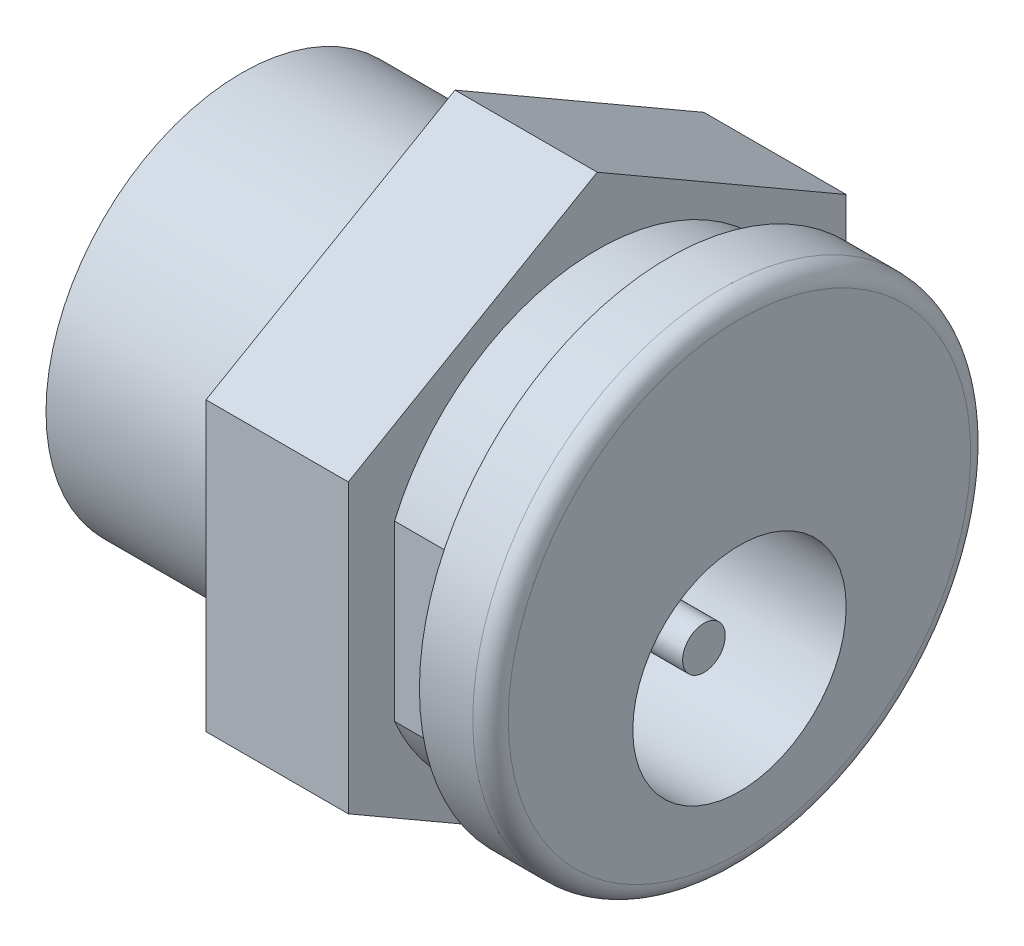
ISO-10303-21;
HEADER;
FILE_DESCRIPTION(('STEP AP214'),'2;1');
FILE_NAME('part.step','',(''),(''),'','','');
FILE_SCHEMA(('AUTOMOTIVE_DESIGN { 1 0 10303 214 1 1 1 1 }'));
ENDSEC;
DATA;
#1=APPLICATION_CONTEXT('core data for automotive mechanical design processes');
#2=APPLICATION_PROTOCOL_DEFINITION('international standard','automotive_design',2000,#1);
#3=PRODUCT_CONTEXT('',#1,'mechanical');
#4=PRODUCT('Part','Part','',(#3));
#5=PRODUCT_RELATED_PRODUCT_CATEGORY('part','',(#4));
#6=PRODUCT_DEFINITION_FORMATION('','',#4);
#7=PRODUCT_DEFINITION_CONTEXT('part definition',#1,'design');
#8=PRODUCT_DEFINITION('design','',#6,#7);
#9=PRODUCT_DEFINITION_SHAPE('','',#8);
#10=(LENGTH_UNIT() NAMED_UNIT(*) SI_UNIT(.MILLI.,.METRE.));
#11=(NAMED_UNIT(*) PLANE_ANGLE_UNIT() SI_UNIT($,.RADIAN.));
#12=(NAMED_UNIT(*) SI_UNIT($,.STERADIAN.) SOLID_ANGLE_UNIT());
#13=UNCERTAINTY_MEASURE_WITH_UNIT(LENGTH_MEASURE(1.E-05),#10,'distance_accuracy_value','');
#14=(GEOMETRIC_REPRESENTATION_CONTEXT(3) GLOBAL_UNCERTAINTY_ASSIGNED_CONTEXT((#13)) GLOBAL_UNIT_ASSIGNED_CONTEXT((#10,
#11,#12)) REPRESENTATION_CONTEXT('',''));
#15=CARTESIAN_POINT('',(0.,0.,0.));
#16=DIRECTION('',(0.,0.,1.));
#17=DIRECTION('',(1.,0.,0.));
#18=AXIS2_PLACEMENT_3D('',#15,#16,#17);
#19=CARTESIAN_POINT('',(0.,0.,0.));
#20=DIRECTION('',(-1.,0.,0.));
#21=DIRECTION('',(0.,0.,1.));
#22=AXIS2_PLACEMENT_3D('',#19,#20,#21);
#23=CYLINDRICAL_SURFACE('',#22,6.2);
#24=CARTESIAN_POINT('',(-2.,0.,0.));
#25=DIRECTION('',(-1.,0.,0.));
#26=DIRECTION('',(0.,0.,1.));
#27=AXIS2_PLACEMENT_3D('',#24,#25,#26);
#28=CIRCLE('',#27,6.2);
#29=CARTESIAN_POINT('',(-2.,-2.4392621835301,-5.7));
#30=VERTEX_POINT('',#29);
#31=CARTESIAN_POINT('',(-2.,-2.43926218353009,5.7));
#32=VERTEX_POINT('',#31);
#33=EDGE_CURVE('E125',#30,#32,#28,.T.);
#34=ORIENTED_EDGE('',*,*,#33,.T.);
#35=DIRECTION('',(-1.,0.,0.));
#36=VECTOR('',#35,1.);
#37=CARTESIAN_POINT('',(-2.,-2.4392621835301,5.7));
#38=LINE('',#37,#36);
#39=CARTESIAN_POINT('',(-4.,-2.4392621835301,5.7));
#40=VERTEX_POINT('',#39);
#41=EDGE_CURVE('E109',#32,#40,#38,.T.);
#42=ORIENTED_EDGE('',*,*,#41,.T.);
#43=CARTESIAN_POINT('',(-4.,0.,0.));
#44=DIRECTION('',(-1.,0.,0.));
#45=DIRECTION('',(0.,0.,1.));
#46=AXIS2_PLACEMENT_3D('',#43,#44,#45);
#47=CIRCLE('',#46,6.2);
#48=CARTESIAN_POINT('',(-4.,-2.4392621835301,-5.7));
#49=VERTEX_POINT('',#48);
#50=EDGE_CURVE('E126',#49,#40,#47,.T.);
#51=ORIENTED_EDGE('',*,*,#50,.F.);
#52=DIRECTION('',(-1.,0.,0.));
#53=VECTOR('',#52,1.);
#54=CARTESIAN_POINT('',(-2.,-2.4392621835301,-5.7));
#55=LINE('',#54,#53);
#56=EDGE_CURVE('E50',#30,#49,#55,.T.);
#57=ORIENTED_EDGE('',*,*,#56,.F.);
#58=EDGE_LOOP('',(#34,#42,#51,#57));
#59=FACE_BOUND('',#58,.T.);
#60=ADVANCED_FACE('F27',(#59),#23,.T.);
#61=CARTESIAN_POINT('',(-4.,2.4392621835301,5.7));
#62=VERTEX_POINT('',#61);
#63=CARTESIAN_POINT('',(-4.,2.4392621835301,-5.7));
#64=VERTEX_POINT('',#63);
#65=EDGE_CURVE('E119',#62,#64,#47,.T.);
#66=ORIENTED_EDGE('',*,*,#65,.F.);
#67=DIRECTION('',(-1.,0.,0.));
#68=VECTOR('',#67,1.);
#69=CARTESIAN_POINT('',(-2.,2.4392621835301,5.7));
#70=LINE('',#69,#68);
#71=CARTESIAN_POINT('',(-2.,2.4392621835301,5.7));
#72=VERTEX_POINT('',#71);
#73=EDGE_CURVE('E106',#72,#62,#70,.T.);
#74=ORIENTED_EDGE('',*,*,#73,.F.);
#75=CARTESIAN_POINT('',(-2.,2.4392621835301,-5.7));
#76=VERTEX_POINT('',#75);
#77=EDGE_CURVE('E117',#72,#76,#28,.T.);
#78=ORIENTED_EDGE('',*,*,#77,.T.);
#79=DIRECTION('',(-1.,0.,0.));
#80=VECTOR('',#79,1.);
#81=CARTESIAN_POINT('',(-2.,2.4392621835301,-5.7));
#82=LINE('',#81,#80);
#83=EDGE_CURVE('E185',#76,#64,#82,.T.);
#84=ORIENTED_EDGE('',*,*,#83,.T.);
#85=EDGE_LOOP('',(#66,#74,#78,#84));
#86=FACE_BOUND('',#85,.T.);
#87=ADVANCED_FACE('F115',(#86),#23,.T.);
#88=CARTESIAN_POINT('',(-9.,-2.,0.));
#89=DIRECTION('',(1.,0.,0.));
#90=DIRECTION('',(0.,0.,-1.));
#91=AXIS2_PLACEMENT_3D('',#88,#89,#90);
#92=CYLINDRICAL_SURFACE('',#91,0.6);
#93=CARTESIAN_POINT('',(-9.,-2.,0.));
#94=DIRECTION('',(1.,0.,0.));
#95=DIRECTION('',(0.,0.,-1.));
#96=AXIS2_PLACEMENT_3D('',#93,#94,#95);
#97=CIRCLE('',#96,0.6);
#98=CARTESIAN_POINT('',(-9.,-2.,-0.6));
#99=VERTEX_POINT('',#98);
#100=EDGE_CURVE('E178',#99,#99,#97,.T.);
#101=ORIENTED_EDGE('',*,*,#100,.T.);
#102=EDGE_LOOP('',(#101));
#103=FACE_BOUND('',#102,.T.);
#104=CARTESIAN_POINT('',(-1.,-2.,0.));
#105=DIRECTION('',(1.,0.,0.));
#106=DIRECTION('',(0.,0.,-1.));
#107=AXIS2_PLACEMENT_3D('',#104,#105,#106);
#108=CIRCLE('',#107,0.6);
#109=CARTESIAN_POINT('',(-1.,-2.,-0.6));
#110=VERTEX_POINT('',#109);
#111=EDGE_CURVE('E179',#110,#110,#108,.T.);
#112=ORIENTED_EDGE('',*,*,#111,.F.);
#113=EDGE_LOOP('',(#112));
#114=FACE_BOUND('',#113,.T.);
#115=ADVANCED_FACE('F158',(#103,#114),#92,.T.);
#116=CARTESIAN_POINT('',(-4.,6.2,0.));
#117=DIRECTION('',(-1.,0.,0.));
#118=DIRECTION('',(0.,0.,1.));
#119=AXIS2_PLACEMENT_3D('',#116,#117,#118);
#120=PLANE('',#119);
#121=ORIENTED_EDGE('',*,*,#50,.T.);
#122=DIRECTION('',(0.,-1.,0.));
#123=VECTOR('',#122,1.);
#124=CARTESIAN_POINT('',(-4.,2.4392621835301,5.7));
#125=LINE('',#124,#123);
#126=EDGE_CURVE('E111',#62,#40,#125,.T.);
#127=ORIENTED_EDGE('',*,*,#126,.F.);
#128=ORIENTED_EDGE('',*,*,#65,.T.);
#129=DIRECTION('',(0.,-1.,0.));
#130=VECTOR('',#129,1.);
#131=CARTESIAN_POINT('',(-4.,2.4392621835301,-5.7));
#132=LINE('',#131,#130);
#133=EDGE_CURVE('E246',#64,#49,#132,.T.);
#134=ORIENTED_EDGE('',*,*,#133,.T.);
#135=EDGE_LOOP('',(#121,#127,#128,#134));
#136=FACE_BOUND('',#135,.T.);
#137=DIRECTION('',(0.,0.5,-0.866025403784439));
#138=VECTOR('',#137,1.);
#139=CARTESIAN_POINT('',(-4.,4.04145188432738,7.));
#140=LINE('',#139,#138);
#141=CARTESIAN_POINT('',(-4.,4.04145188432738,7.));
#142=VERTEX_POINT('',#141);
#143=CARTESIAN_POINT('',(-4.,8.08290376865476,0.));
#144=VERTEX_POINT('',#143);
#145=EDGE_CURVE('E209',#142,#144,#140,.T.);
#146=ORIENTED_EDGE('',*,*,#145,.F.);
#147=DIRECTION('',(0.,1.,0.));
#148=VECTOR('',#147,1.);
#149=CARTESIAN_POINT('',(-4.,-4.04145188432739,7.));
#150=LINE('',#149,#148);
#151=CARTESIAN_POINT('',(-4.,-4.04145188432739,7.));
#152=VERTEX_POINT('',#151);
#153=EDGE_CURVE('E223',#152,#142,#150,.T.);
#154=ORIENTED_EDGE('',*,*,#153,.F.);
#155=DIRECTION('',(0.,0.5,0.866025403784439));
#156=VECTOR('',#155,1.);
#157=CARTESIAN_POINT('',(-4.,-8.08290376865476,0.));
#158=LINE('',#157,#156);
#159=CARTESIAN_POINT('',(-4.,-8.08290376865476,0.));
#160=VERTEX_POINT('',#159);
#161=EDGE_CURVE('E220',#160,#152,#158,.T.);
#162=ORIENTED_EDGE('',*,*,#161,.F.);
#163=DIRECTION('',(0.,-0.5,0.866025403784439));
#164=VECTOR('',#163,1.);
#165=CARTESIAN_POINT('',(-4.,-4.04145188432738,-7.));
#166=LINE('',#165,#164);
#167=CARTESIAN_POINT('',(-4.,-4.04145188432738,-7.));
#168=VERTEX_POINT('',#167);
#169=EDGE_CURVE('E217',#168,#160,#166,.T.);
#170=ORIENTED_EDGE('',*,*,#169,.F.);
#171=DIRECTION('',(0.,-1.,0.));
#172=VECTOR('',#171,1.);
#173=CARTESIAN_POINT('',(-4.,4.04145188432738,-7.));
#174=LINE('',#173,#172);
#175=CARTESIAN_POINT('',(-4.,4.04145188432738,-7.));
#176=VERTEX_POINT('',#175);
#177=EDGE_CURVE('E214',#176,#168,#174,.T.);
#178=ORIENTED_EDGE('',*,*,#177,.F.);
#179=DIRECTION('',(0.,-0.5,-0.866025403784439));
#180=VECTOR('',#179,1.);
#181=CARTESIAN_POINT('',(-4.,8.08290376865476,0.));
#182=LINE('',#181,#180);
#183=EDGE_CURVE('E211',#144,#176,#182,.T.);
#184=ORIENTED_EDGE('',*,*,#183,.F.);
#185=EDGE_LOOP('',(#146,#154,#162,#170,#178,#184));
#186=FACE_BOUND('',#185,.T.);
#187=ADVANCED_FACE('F161',(#136,#186),#120,.F.);
#188=CARTESIAN_POINT('',(0.,0.,0.));
#189=DIRECTION('',(-1.,0.,0.));
#190=DIRECTION('',(0.,0.,1.));
#191=AXIS2_PLACEMENT_3D('',#188,#189,#190);
#192=PLANE('',#191);
#193=CARTESIAN_POINT('',(0.,0.,0.));
#194=DIRECTION('',(-1.,0.,0.));
#195=DIRECTION('',(0.,0.,1.));
#196=AXIS2_PLACEMENT_3D('',#193,#194,#195);
#197=CIRCLE('',#196,6.5);
#198=CARTESIAN_POINT('',(0.,0.,6.5));
#199=VERTEX_POINT('',#198);
#200=EDGE_CURVE('E11',#199,#199,#197,.F.);
#201=ORIENTED_EDGE('',*,*,#200,.T.);
#202=EDGE_LOOP('',(#201));
#203=FACE_BOUND('',#202,.T.);
#204=CARTESIAN_POINT('',(0.,-2.,0.));
#205=DIRECTION('',(1.,0.,0.));
#206=DIRECTION('',(0.,0.,-1.));
#207=AXIS2_PLACEMENT_3D('',#204,#205,#206);
#208=CIRCLE('',#207,3.);
#209=CARTESIAN_POINT('',(0.,-2.,-3.));
#210=VERTEX_POINT('',#209);
#211=EDGE_CURVE('E176',#210,#210,#208,.T.);
#212=ORIENTED_EDGE('',*,*,#211,.F.);
#213=EDGE_LOOP('',(#212));
#214=FACE_BOUND('',#213,.T.);
#215=ADVANCED_FACE('F29',(#203,#214),#192,.F.);
#216=CARTESIAN_POINT('',(0.,0.,0.));
#217=DIRECTION('',(-1.,0.,0.));
#218=DIRECTION('',(0.,0.,1.));
#219=AXIS2_PLACEMENT_3D('',#216,#217,#218);
#220=CYLINDRICAL_SURFACE('',#219,7.);
#221=CARTESIAN_POINT('',(-0.5,0.,0.));
#222=DIRECTION('',(-1.,0.,0.));
#223=DIRECTION('',(0.,0.,1.));
#224=AXIS2_PLACEMENT_3D('',#221,#222,#223);
#225=CIRCLE('',#224,7.);
#226=CARTESIAN_POINT('',(-0.5,0.,7.));
#227=VERTEX_POINT('',#226);
#228=EDGE_CURVE('E35',#227,#227,#225,.T.);
#229=ORIENTED_EDGE('',*,*,#228,.T.);
#230=EDGE_LOOP('',(#229));
#231=FACE_BOUND('',#230,.T.);
#232=CARTESIAN_POINT('',(-2.,0.,0.));
#233=DIRECTION('',(-1.,0.,0.));
#234=DIRECTION('',(0.,0.,1.));
#235=AXIS2_PLACEMENT_3D('',#232,#233,#234);
#236=CIRCLE('',#235,7.);
#237=CARTESIAN_POINT('',(-2.,0.,7.));
#238=VERTEX_POINT('',#237);
#239=EDGE_CURVE('E128',#238,#238,#236,.T.);
#240=ORIENTED_EDGE('',*,*,#239,.F.);
#241=EDGE_LOOP('',(#240));
#242=FACE_BOUND('',#241,.T.);
#243=ADVANCED_FACE('F137',(#231,#242),#220,.T.);
#244=CARTESIAN_POINT('',(-2.,7.,0.));
#245=DIRECTION('',(1.,0.,0.));
#246=DIRECTION('',(0.,0.,-1.));
#247=AXIS2_PLACEMENT_3D('',#244,#245,#246);
#248=PLANE('',#247);
#249=ORIENTED_EDGE('',*,*,#33,.F.);
#250=DIRECTION('',(0.,-1.,0.));
#251=VECTOR('',#250,1.);
#252=CARTESIAN_POINT('',(-2.,2.4392621835301,-5.7));
#253=LINE('',#252,#251);
#254=EDGE_CURVE('E123',#76,#30,#253,.T.);
#255=ORIENTED_EDGE('',*,*,#254,.F.);
#256=ORIENTED_EDGE('',*,*,#77,.F.);
#257=DIRECTION('',(0.,-1.,0.));
#258=VECTOR('',#257,1.);
#259=CARTESIAN_POINT('',(-2.,2.4392621835301,5.7));
#260=LINE('',#259,#258);
#261=EDGE_CURVE('E42',#72,#32,#260,.T.);
#262=ORIENTED_EDGE('',*,*,#261,.T.);
#263=EDGE_LOOP('',(#249,#255,#256,#262));
#264=FACE_BOUND('',#263,.T.);
#265=ORIENTED_EDGE('',*,*,#239,.T.);
#266=EDGE_LOOP('',(#265));
#267=FACE_BOUND('',#266,.T.);
#268=ADVANCED_FACE('F121',(#264,#267),#248,.F.);
#269=CARTESIAN_POINT('',(-4.,4.04145188432738,7.));
#270=DIRECTION('',(0.,0.866025403784439,0.5));
#271=DIRECTION('',(0.,-0.5,0.866025403784439));
#272=AXIS2_PLACEMENT_3D('',#269,#270,#271);
#273=PLANE('',#272);
#274=DIRECTION('',(0.,0.5,-0.866025403784439));
#275=VECTOR('',#274,1.);
#276=CARTESIAN_POINT('',(-8.,4.04145188432738,7.));
#277=LINE('',#276,#275);
#278=CARTESIAN_POINT('',(-8.,4.04145188432738,7.));
#279=VERTEX_POINT('',#278);
#280=CARTESIAN_POINT('',(-8.,8.08290376865476,0.));
#281=VERTEX_POINT('',#280);
#282=EDGE_CURVE('E191',#279,#281,#277,.T.);
#283=ORIENTED_EDGE('',*,*,#282,.F.);
#284=DIRECTION('',(-1.,0.,0.));
#285=VECTOR('',#284,1.);
#286=CARTESIAN_POINT('',(-4.,4.04145188432738,7.));
#287=LINE('',#286,#285);
#288=EDGE_CURVE('E227',#142,#279,#287,.T.);
#289=ORIENTED_EDGE('',*,*,#288,.F.);
#290=ORIENTED_EDGE('',*,*,#145,.T.);
#291=DIRECTION('',(-1.,0.,0.));
#292=VECTOR('',#291,1.);
#293=CARTESIAN_POINT('',(-4.,8.08290376865476,0.));
#294=LINE('',#293,#292);
#295=EDGE_CURVE('E226',#144,#281,#294,.T.);
#296=ORIENTED_EDGE('',*,*,#295,.T.);
#297=EDGE_LOOP('',(#283,#289,#290,#296));
#298=FACE_BOUND('',#297,.T.);
#299=ADVANCED_FACE('F164',(#298),#273,.T.);
#300=CARTESIAN_POINT('',(-4.,-4.04145188432739,7.));
#301=DIRECTION('',(0.,0.,1.));
#302=DIRECTION('',(0.,-1.,0.));
#303=AXIS2_PLACEMENT_3D('',#300,#301,#302);
#304=PLANE('',#303);
#305=DIRECTION('',(0.,1.,0.));
#306=VECTOR('',#305,1.);
#307=CARTESIAN_POINT('',(-8.,-4.04145188432739,7.));
#308=LINE('',#307,#306);
#309=CARTESIAN_POINT('',(-8.,-4.04145188432739,7.));
#310=VERTEX_POINT('',#309);
#311=EDGE_CURVE('E206',#310,#279,#308,.T.);
#312=ORIENTED_EDGE('',*,*,#311,.F.);
#313=DIRECTION('',(-1.,0.,0.));
#314=VECTOR('',#313,1.);
#315=CARTESIAN_POINT('',(-4.,-4.04145188432739,7.));
#316=LINE('',#315,#314);
#317=EDGE_CURVE('E230',#152,#310,#316,.T.);
#318=ORIENTED_EDGE('',*,*,#317,.F.);
#319=ORIENTED_EDGE('',*,*,#153,.T.);
#320=ORIENTED_EDGE('',*,*,#288,.T.);
#321=EDGE_LOOP('',(#312,#318,#319,#320));
#322=FACE_BOUND('',#321,.T.);
#323=ADVANCED_FACE('F273',(#322),#304,.T.);
#324=CARTESIAN_POINT('',(-4.,-8.08290376865476,0.));
#325=DIRECTION('',(0.,-0.866025403784439,0.5));
#326=DIRECTION('',(0.,-0.5,-0.866025403784439));
#327=AXIS2_PLACEMENT_3D('',#324,#325,#326);
#328=PLANE('',#327);
#329=DIRECTION('',(0.,0.5,0.866025403784439));
#330=VECTOR('',#329,1.);
#331=CARTESIAN_POINT('',(-8.,-8.08290376865476,0.));
#332=LINE('',#331,#330);
#333=CARTESIAN_POINT('',(-8.,-8.08290376865476,0.));
#334=VERTEX_POINT('',#333);
#335=EDGE_CURVE('E203',#334,#310,#332,.T.);
#336=ORIENTED_EDGE('',*,*,#335,.F.);
#337=DIRECTION('',(-1.,0.,0.));
#338=VECTOR('',#337,1.);
#339=CARTESIAN_POINT('',(-4.,-8.08290376865476,0.));
#340=LINE('',#339,#338);
#341=EDGE_CURVE('E232',#160,#334,#340,.T.);
#342=ORIENTED_EDGE('',*,*,#341,.F.);
#343=ORIENTED_EDGE('',*,*,#161,.T.);
#344=ORIENTED_EDGE('',*,*,#317,.T.);
#345=EDGE_LOOP('',(#336,#342,#343,#344));
#346=FACE_BOUND('',#345,.T.);
#347=ADVANCED_FACE('F276',(#346),#328,.T.);
#348=CARTESIAN_POINT('',(-4.,-4.04145188432738,-7.));
#349=DIRECTION('',(0.,-0.866025403784439,-0.5));
#350=DIRECTION('',(0.,0.5,-0.866025403784439));
#351=AXIS2_PLACEMENT_3D('',#348,#349,#350);
#352=PLANE('',#351);
#353=DIRECTION('',(0.,-0.5,0.866025403784439));
#354=VECTOR('',#353,1.);
#355=CARTESIAN_POINT('',(-8.,-4.04145188432738,-7.));
#356=LINE('',#355,#354);
#357=CARTESIAN_POINT('',(-8.,-4.04145188432738,-7.));
#358=VERTEX_POINT('',#357);
#359=EDGE_CURVE('E200',#358,#334,#356,.T.);
#360=ORIENTED_EDGE('',*,*,#359,.F.);
#361=DIRECTION('',(-1.,0.,0.));
#362=VECTOR('',#361,1.);
#363=CARTESIAN_POINT('',(-4.,-4.04145188432738,-7.));
#364=LINE('',#363,#362);
#365=EDGE_CURVE('E234',#168,#358,#364,.T.);
#366=ORIENTED_EDGE('',*,*,#365,.F.);
#367=ORIENTED_EDGE('',*,*,#169,.T.);
#368=ORIENTED_EDGE('',*,*,#341,.T.);
#369=EDGE_LOOP('',(#360,#366,#367,#368));
#370=FACE_BOUND('',#369,.T.);
#371=ADVANCED_FACE('F280',(#370),#352,.T.);
#372=CARTESIAN_POINT('',(-4.,4.04145188432738,-7.));
#373=DIRECTION('',(0.,0.,-1.));
#374=DIRECTION('',(-1.,0.,0.));
#375=AXIS2_PLACEMENT_3D('',#372,#373,#374);
#376=PLANE('',#375);
#377=DIRECTION('',(0.,-1.,0.));
#378=VECTOR('',#377,1.);
#379=CARTESIAN_POINT('',(-8.,4.04145188432738,-7.));
#380=LINE('',#379,#378);
#381=CARTESIAN_POINT('',(-8.,4.04145188432738,-7.));
#382=VERTEX_POINT('',#381);
#383=EDGE_CURVE('E197',#382,#358,#380,.T.);
#384=ORIENTED_EDGE('',*,*,#383,.F.);
#385=DIRECTION('',(-1.,0.,0.));
#386=VECTOR('',#385,1.);
#387=CARTESIAN_POINT('',(-4.,4.04145188432738,-7.));
#388=LINE('',#387,#386);
#389=EDGE_CURVE('E236',#176,#382,#388,.T.);
#390=ORIENTED_EDGE('',*,*,#389,.F.);
#391=ORIENTED_EDGE('',*,*,#177,.T.);
#392=ORIENTED_EDGE('',*,*,#365,.T.);
#393=EDGE_LOOP('',(#384,#390,#391,#392));
#394=FACE_BOUND('',#393,.T.);
#395=ADVANCED_FACE('F284',(#394),#376,.T.);
#396=CARTESIAN_POINT('',(-4.,8.08290376865476,0.));
#397=DIRECTION('',(0.,0.866025403784439,-0.5));
#398=DIRECTION('',(0.,0.5,0.866025403784439));
#399=AXIS2_PLACEMENT_3D('',#396,#397,#398);
#400=PLANE('',#399);
#401=DIRECTION('',(0.,-0.5,-0.866025403784439));
#402=VECTOR('',#401,1.);
#403=CARTESIAN_POINT('',(-8.,8.08290376865476,0.));
#404=LINE('',#403,#402);
#405=EDGE_CURVE('E194',#281,#382,#404,.T.);
#406=ORIENTED_EDGE('',*,*,#405,.F.);
#407=ORIENTED_EDGE('',*,*,#295,.F.);
#408=ORIENTED_EDGE('',*,*,#183,.T.);
#409=ORIENTED_EDGE('',*,*,#389,.T.);
#410=EDGE_LOOP('',(#406,#407,#408,#409));
#411=FACE_BOUND('',#410,.T.);
#412=ADVANCED_FACE('F288',(#411),#400,.T.);
#413=CARTESIAN_POINT('',(-14.,5.5,0.));
#414=DIRECTION('',(1.,0.,0.));
#415=DIRECTION('',(0.,0.,-1.));
#416=AXIS2_PLACEMENT_3D('',#413,#414,#415);
#417=PLANE('',#416);
#418=CARTESIAN_POINT('',(-14.,0.,0.));
#419=DIRECTION('',(-1.,0.,0.));
#420=DIRECTION('',(0.,0.,1.));
#421=AXIS2_PLACEMENT_3D('',#418,#419,#420);
#422=CIRCLE('',#421,5.5);
#423=CARTESIAN_POINT('',(-14.,0.,5.5));
#424=VERTEX_POINT('',#423);
#425=EDGE_CURVE('E229',#424,#424,#422,.T.);
#426=ORIENTED_EDGE('',*,*,#425,.T.);
#427=EDGE_LOOP('',(#426));
#428=FACE_BOUND('',#427,.T.);
#429=ADVANCED_FACE('F292',(#428),#417,.F.);
#430=CARTESIAN_POINT('',(0.,0.,0.));
#431=DIRECTION('',(-1.,0.,0.));
#432=DIRECTION('',(0.,0.,1.));
#433=AXIS2_PLACEMENT_3D('',#430,#431,#432);
#434=CYLINDRICAL_SURFACE('',#433,5.5);
#435=ORIENTED_EDGE('',*,*,#425,.F.);
#436=EDGE_LOOP('',(#435));
#437=FACE_BOUND('',#436,.T.);
#438=CARTESIAN_POINT('',(-8.,0.,0.));
#439=DIRECTION('',(-1.,0.,0.));
#440=DIRECTION('',(0.,0.,1.));
#441=AXIS2_PLACEMENT_3D('',#438,#439,#440);
#442=CIRCLE('',#441,5.5);
#443=CARTESIAN_POINT('',(-8.,0.,5.5));
#444=VERTEX_POINT('',#443);
#445=EDGE_CURVE('E241',#444,#444,#442,.T.);
#446=ORIENTED_EDGE('',*,*,#445,.T.);
#447=EDGE_LOOP('',(#446));
#448=FACE_BOUND('',#447,.T.);
#449=ADVANCED_FACE('F299',(#437,#448),#434,.T.);
#450=CARTESIAN_POINT('',(-8.,10.,0.));
#451=DIRECTION('',(1.,0.,0.));
#452=DIRECTION('',(0.,0.,-1.));
#453=AXIS2_PLACEMENT_3D('',#450,#451,#452);
#454=PLANE('',#453);
#455=ORIENTED_EDGE('',*,*,#445,.F.);
#456=EDGE_LOOP('',(#455));
#457=FACE_BOUND('',#456,.T.);
#458=ORIENTED_EDGE('',*,*,#282,.T.);
#459=ORIENTED_EDGE('',*,*,#405,.T.);
#460=ORIENTED_EDGE('',*,*,#383,.T.);
#461=ORIENTED_EDGE('',*,*,#359,.T.);
#462=ORIENTED_EDGE('',*,*,#335,.T.);
#463=ORIENTED_EDGE('',*,*,#311,.T.);
#464=EDGE_LOOP('',(#458,#459,#460,#461,#462,#463));
#465=FACE_BOUND('',#464,.T.);
#466=ADVANCED_FACE('F268',(#457,#465),#454,.F.);
#467=CARTESIAN_POINT('',(-9.,-2.,0.));
#468=DIRECTION('',(1.,0.,0.));
#469=DIRECTION('',(0.,0.,-1.));
#470=AXIS2_PLACEMENT_3D('',#467,#468,#469);
#471=CYLINDRICAL_SURFACE('',#470,3.);
#472=CARTESIAN_POINT('',(-9.,-2.,0.));
#473=DIRECTION('',(1.,0.,0.));
#474=DIRECTION('',(0.,0.,-1.));
#475=AXIS2_PLACEMENT_3D('',#472,#473,#474);
#476=CIRCLE('',#475,3.);
#477=CARTESIAN_POINT('',(-9.,-2.,-3.));
#478=VERTEX_POINT('',#477);
#479=EDGE_CURVE('E182',#478,#478,#476,.T.);
#480=ORIENTED_EDGE('',*,*,#479,.F.);
#481=EDGE_LOOP('',(#480));
#482=FACE_BOUND('',#481,.T.);
#483=ORIENTED_EDGE('',*,*,#211,.T.);
#484=EDGE_LOOP('',(#483));
#485=FACE_BOUND('',#484,.T.);
#486=ADVANCED_FACE('F264',(#482,#485),#471,.F.);
#487=CARTESIAN_POINT('',(-9.,0.,-15.5414213562373));
#488=DIRECTION('',(1.,0.,0.));
#489=DIRECTION('',(0.,0.,-1.));
#490=AXIS2_PLACEMENT_3D('',#487,#488,#489);
#491=PLANE('',#490);
#492=ORIENTED_EDGE('',*,*,#100,.F.);
#493=EDGE_LOOP('',(#492));
#494=FACE_BOUND('',#493,.T.);
#495=ORIENTED_EDGE('',*,*,#479,.T.);
#496=EDGE_LOOP('',(#495));
#497=FACE_BOUND('',#496,.T.);
#498=ADVANCED_FACE('F258',(#494,#497),#491,.T.);
#499=CARTESIAN_POINT('',(-1.,-2.,0.));
#500=DIRECTION('',(1.,0.,0.));
#501=DIRECTION('',(0.,0.,-1.));
#502=AXIS2_PLACEMENT_3D('',#499,#500,#501);
#503=PLANE('',#502);
#504=ORIENTED_EDGE('',*,*,#111,.T.);
#505=EDGE_LOOP('',(#504));
#506=FACE_BOUND('',#505,.T.);
#507=ADVANCED_FACE('F254',(#506),#503,.T.);
#508=CARTESIAN_POINT('',(-2.,2.4392621835301,-5.7));
#509=DIRECTION('',(0.,0.,-1.));
#510=DIRECTION('',(-1.,0.,0.));
#511=AXIS2_PLACEMENT_3D('',#508,#509,#510);
#512=PLANE('',#511);
#513=ORIENTED_EDGE('',*,*,#133,.F.);
#514=ORIENTED_EDGE('',*,*,#83,.F.);
#515=ORIENTED_EDGE('',*,*,#254,.T.);
#516=ORIENTED_EDGE('',*,*,#56,.T.);
#517=EDGE_LOOP('',(#513,#514,#515,#516));
#518=FACE_BOUND('',#517,.T.);
#519=ADVANCED_FACE('F148',(#518),#512,.T.);
#520=CARTESIAN_POINT('',(-2.,2.4392621835301,5.7));
#521=DIRECTION('',(0.,0.,-1.));
#522=DIRECTION('',(-1.,0.,0.));
#523=AXIS2_PLACEMENT_3D('',#520,#521,#522);
#524=PLANE('',#523);
#525=ORIENTED_EDGE('',*,*,#126,.T.);
#526=ORIENTED_EDGE('',*,*,#41,.F.);
#527=ORIENTED_EDGE('',*,*,#261,.F.);
#528=ORIENTED_EDGE('',*,*,#73,.T.);
#529=EDGE_LOOP('',(#525,#526,#527,#528));
#530=FACE_BOUND('',#529,.T.);
#531=ADVANCED_FACE('F105',(#530),#524,.F.);
#532=CARTESIAN_POINT('',(-0.5,0.,0.));
#533=DIRECTION('',(-1.,0.,0.));
#534=DIRECTION('',(0.,0.,1.));
#535=AXIS2_PLACEMENT_3D('',#532,#533,#534);
#536=TOROIDAL_SURFACE('',#535,6.5,0.5);
#537=ORIENTED_EDGE('',*,*,#200,.F.);
#538=EDGE_LOOP('',(#537));
#539=FACE_BOUND('',#538,.T.);
#540=ORIENTED_EDGE('',*,*,#228,.F.);
#541=EDGE_LOOP('',(#540));
#542=FACE_BOUND('',#541,.T.);
#543=ADVANCED_FACE('F140',(#539,#542),#536,.T.);
#544=CLOSED_SHELL('',(#60,#87,#115,#187,#215,#243,#268,#299,#323,#347,#371,#395,#412,#429,#449,
#466,#486,#498,#507,#519,#531,#543));
#545=MANIFOLD_SOLID_BREP('B2',#544);
#546=ADVANCED_BREP_SHAPE_REPRESENTATION('',(#18,#545),#14);
#547=SHAPE_DEFINITION_REPRESENTATION(#9,#546);
ENDSEC;
END-ISO-10303-21;
